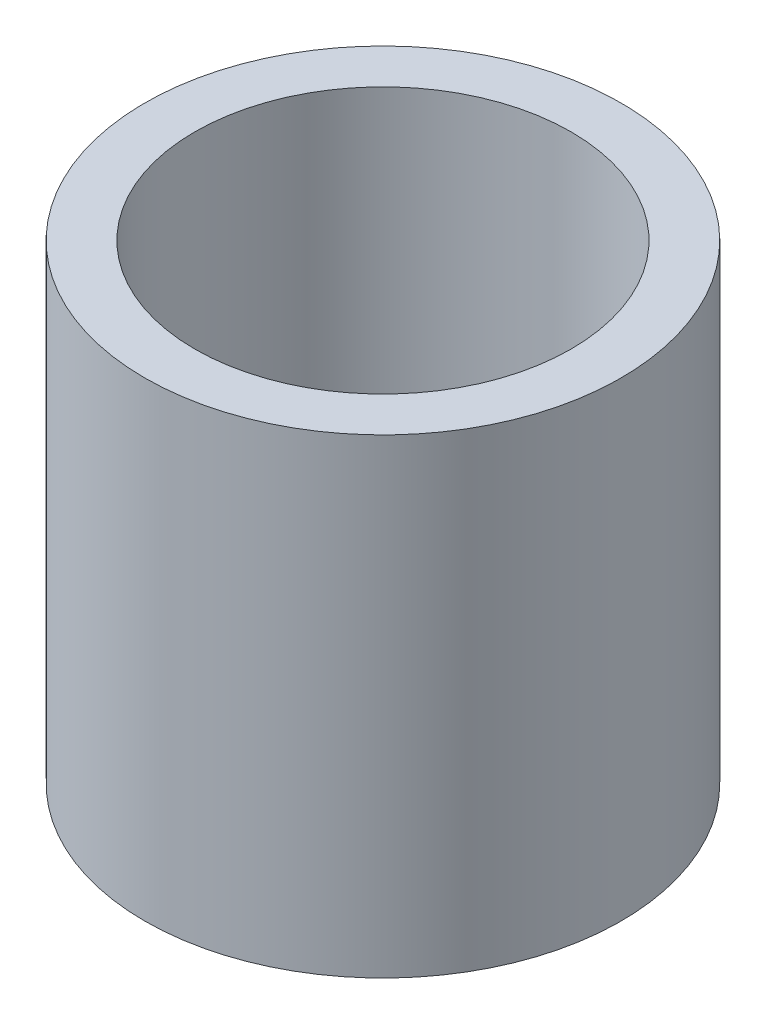
ISO-10303-21;
HEADER;
FILE_DESCRIPTION(('STEP AP214'),'2;1');
FILE_NAME('part.step','',(''),(''),'','','');
FILE_SCHEMA(('AUTOMOTIVE_DESIGN { 1 0 10303 214 1 1 1 1 }'));
ENDSEC;
DATA;
#1=APPLICATION_CONTEXT('core data for automotive mechanical design processes');
#2=APPLICATION_PROTOCOL_DEFINITION('international standard','automotive_design',2000,#1);
#3=PRODUCT_CONTEXT('',#1,'mechanical');
#4=PRODUCT('Part','Part','',(#3));
#5=PRODUCT_RELATED_PRODUCT_CATEGORY('part','',(#4));
#6=PRODUCT_DEFINITION_FORMATION('','',#4);
#7=PRODUCT_DEFINITION_CONTEXT('part definition',#1,'design');
#8=PRODUCT_DEFINITION('design','',#6,#7);
#9=PRODUCT_DEFINITION_SHAPE('','',#8);
#10=(LENGTH_UNIT() NAMED_UNIT(*) SI_UNIT(.MILLI.,.METRE.));
#11=(NAMED_UNIT(*) PLANE_ANGLE_UNIT() SI_UNIT($,.RADIAN.));
#12=(NAMED_UNIT(*) SI_UNIT($,.STERADIAN.) SOLID_ANGLE_UNIT());
#13=UNCERTAINTY_MEASURE_WITH_UNIT(LENGTH_MEASURE(1.E-05),#10,'distance_accuracy_value','');
#14=(GEOMETRIC_REPRESENTATION_CONTEXT(3) GLOBAL_UNCERTAINTY_ASSIGNED_CONTEXT((#13)) GLOBAL_UNIT_ASSIGNED_CONTEXT((#10,
#11,#12)) REPRESENTATION_CONTEXT('',''));
#15=CARTESIAN_POINT('',(0.,0.,0.));
#16=DIRECTION('',(0.,0.,1.));
#17=DIRECTION('',(1.,0.,0.));
#18=AXIS2_PLACEMENT_3D('',#15,#16,#17);
#19=CARTESIAN_POINT('',(0.,19.75,0.));
#20=DIRECTION('',(0.,1.,0.));
#21=DIRECTION('',(0.,0.,1.));
#22=AXIS2_PLACEMENT_3D('',#19,#20,#21);
#23=PLANE('',#22);
#24=CARTESIAN_POINT('',(0.,19.75,0.));
#25=DIRECTION('',(0.,1.,0.));
#26=DIRECTION('',(0.,0.,1.));
#27=AXIS2_PLACEMENT_3D('',#24,#25,#26);
#28=CIRCLE('',#27,10.);
#29=CARTESIAN_POINT('',(0.,19.75,10.));
#30=VERTEX_POINT('',#29);
#31=EDGE_CURVE('E10',#30,#30,#28,.T.);
#32=ORIENTED_EDGE('',*,*,#31,.T.);
#33=EDGE_LOOP('',(#32));
#34=FACE_BOUND('',#33,.T.);
#35=CARTESIAN_POINT('',(0.,19.75,0.));
#36=DIRECTION('',(0.,1.,0.));
#37=DIRECTION('',(0.,0.,1.));
#38=AXIS2_PLACEMENT_3D('',#35,#36,#37);
#39=CIRCLE('',#38,7.9);
#40=CARTESIAN_POINT('',(0.,19.75,7.9));
#41=VERTEX_POINT('',#40);
#42=EDGE_CURVE('E41',#41,#41,#39,.T.);
#43=ORIENTED_EDGE('',*,*,#42,.F.);
#44=EDGE_LOOP('',(#43));
#45=FACE_BOUND('',#44,.T.);
#46=ADVANCED_FACE('F30',(#34,#45),#23,.T.);
#47=CARTESIAN_POINT('',(0.,0.,0.));
#48=DIRECTION('',(0.,1.,0.));
#49=DIRECTION('',(0.,0.,1.));
#50=AXIS2_PLACEMENT_3D('',#47,#48,#49);
#51=PLANE('',#50);
#52=CARTESIAN_POINT('',(0.,0.,0.));
#53=DIRECTION('',(0.,1.,0.));
#54=DIRECTION('',(0.,0.,1.));
#55=AXIS2_PLACEMENT_3D('',#52,#53,#54);
#56=CIRCLE('',#55,10.);
#57=CARTESIAN_POINT('',(0.,0.,10.));
#58=VERTEX_POINT('',#57);
#59=EDGE_CURVE('E34',#58,#58,#56,.T.);
#60=ORIENTED_EDGE('',*,*,#59,.F.);
#61=EDGE_LOOP('',(#60));
#62=FACE_BOUND('',#61,.T.);
#63=CARTESIAN_POINT('',(0.,0.,0.));
#64=DIRECTION('',(0.,1.,0.));
#65=DIRECTION('',(0.,0.,1.));
#66=AXIS2_PLACEMENT_3D('',#63,#64,#65);
#67=CIRCLE('',#66,7.9);
#68=CARTESIAN_POINT('',(0.,0.,7.9));
#69=VERTEX_POINT('',#68);
#70=EDGE_CURVE('E43',#69,#69,#67,.T.);
#71=ORIENTED_EDGE('',*,*,#70,.T.);
#72=EDGE_LOOP('',(#71));
#73=FACE_BOUND('',#72,.T.);
#74=ADVANCED_FACE('F53',(#62,#73),#51,.F.);
#75=CARTESIAN_POINT('',(0.,19.75,0.));
#76=DIRECTION('',(0.,-1.,0.));
#77=DIRECTION('',(0.,0.,-1.));
#78=AXIS2_PLACEMENT_3D('',#75,#76,#77);
#79=CYLINDRICAL_SURFACE('',#78,10.);
#80=ORIENTED_EDGE('',*,*,#31,.F.);
#81=EDGE_LOOP('',(#80));
#82=FACE_BOUND('',#81,.T.);
#83=ORIENTED_EDGE('',*,*,#59,.T.);
#84=EDGE_LOOP('',(#83));
#85=FACE_BOUND('',#84,.T.);
#86=ADVANCED_FACE('F32',(#82,#85),#79,.T.);
#87=CARTESIAN_POINT('',(0.,19.75,0.));
#88=DIRECTION('',(0.,-1.,0.));
#89=DIRECTION('',(0.,0.,-1.));
#90=AXIS2_PLACEMENT_3D('',#87,#88,#89);
#91=CYLINDRICAL_SURFACE('',#90,7.9);
#92=ORIENTED_EDGE('',*,*,#42,.T.);
#93=EDGE_LOOP('',(#92));
#94=FACE_BOUND('',#93,.T.);
#95=ORIENTED_EDGE('',*,*,#70,.F.);
#96=EDGE_LOOP('',(#95));
#97=FACE_BOUND('',#96,.T.);
#98=ADVANCED_FACE('F49',(#94,#97),#91,.F.);
#99=CLOSED_SHELL('',(#46,#74,#86,#98));
#100=MANIFOLD_SOLID_BREP('B2',#99);
#101=ADVANCED_BREP_SHAPE_REPRESENTATION('',(#18,#100),#14);
#102=SHAPE_DEFINITION_REPRESENTATION(#9,#101);
ENDSEC;
END-ISO-10303-21;
